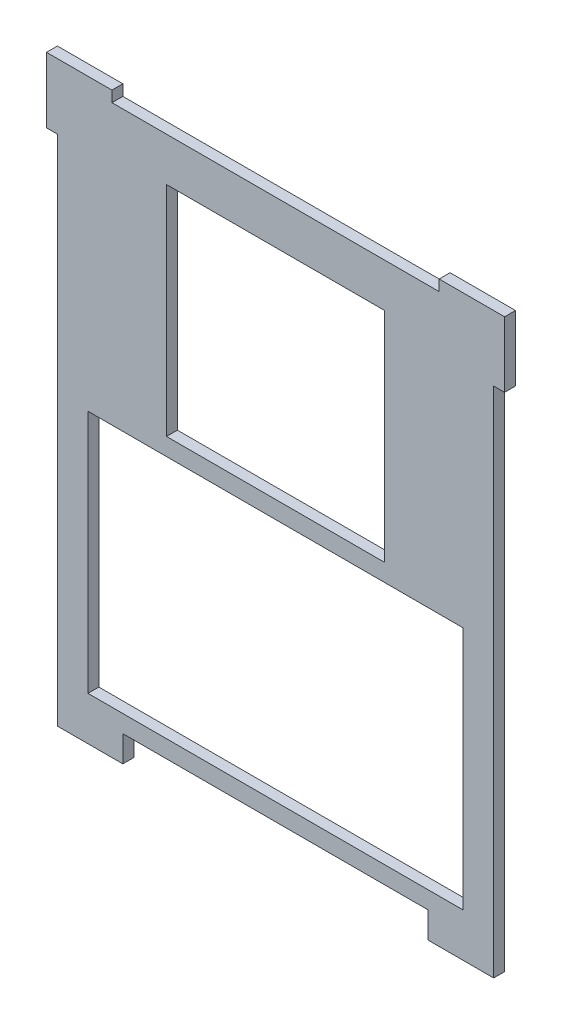
ISO-10303-21;
HEADER;
FILE_DESCRIPTION(('STEP AP214'),'2;1');
FILE_NAME('part.step','',(''),(''),'','','');
FILE_SCHEMA(('AUTOMOTIVE_DESIGN { 1 0 10303 214 1 1 1 1 }'));
ENDSEC;
DATA;
#1=APPLICATION_CONTEXT('core data for automotive mechanical design processes');
#2=APPLICATION_PROTOCOL_DEFINITION('international standard','automotive_design',2000,#1);
#3=PRODUCT_CONTEXT('',#1,'mechanical');
#4=PRODUCT('Part','Part','',(#3));
#5=PRODUCT_RELATED_PRODUCT_CATEGORY('part','',(#4));
#6=PRODUCT_DEFINITION_FORMATION('','',#4);
#7=PRODUCT_DEFINITION_CONTEXT('part definition',#1,'design');
#8=PRODUCT_DEFINITION('design','',#6,#7);
#9=PRODUCT_DEFINITION_SHAPE('','',#8);
#10=(LENGTH_UNIT() NAMED_UNIT(*) SI_UNIT(.MILLI.,.METRE.));
#11=(NAMED_UNIT(*) PLANE_ANGLE_UNIT() SI_UNIT($,.RADIAN.));
#12=(NAMED_UNIT(*) SI_UNIT($,.STERADIAN.) SOLID_ANGLE_UNIT());
#13=UNCERTAINTY_MEASURE_WITH_UNIT(LENGTH_MEASURE(1.E-05),#10,'distance_accuracy_value','');
#14=(GEOMETRIC_REPRESENTATION_CONTEXT(3) GLOBAL_UNCERTAINTY_ASSIGNED_CONTEXT((#13)) GLOBAL_UNIT_ASSIGNED_CONTEXT((#10,
#11,#12)) REPRESENTATION_CONTEXT('',''));
#15=CARTESIAN_POINT('',(0.,0.,0.));
#16=DIRECTION('',(0.,0.,1.));
#17=DIRECTION('',(1.,0.,0.));
#18=AXIS2_PLACEMENT_3D('',#15,#16,#17);
#19=CARTESIAN_POINT('',(-63.5,-88.9,3.175));
#20=DIRECTION('',(1.,0.,0.));
#21=DIRECTION('',(0.,0.,-1.));
#22=AXIS2_PLACEMENT_3D('',#19,#20,#21);
#23=PLANE('',#22);
#24=DIRECTION('',(0.,-1.,0.));
#25=VECTOR('',#24,1.);
#26=CARTESIAN_POINT('',(-63.5,-88.9,0.));
#27=LINE('',#26,#25);
#28=CARTESIAN_POINT('',(-63.5,73.025,0.));
#29=VERTEX_POINT('',#28);
#30=CARTESIAN_POINT('',(-63.5,-76.2,0.));
#31=VERTEX_POINT('',#30);
#32=EDGE_CURVE('E365',#29,#31,#27,.T.);
#33=ORIENTED_EDGE('',*,*,#32,.T.);
#34=DIRECTION('',(0.,0.,1.));
#35=VECTOR('',#34,1.);
#36=CARTESIAN_POINT('',(-63.5,-76.2,-0.00100000000000013));
#37=LINE('',#36,#35);
#38=CARTESIAN_POINT('',(-63.5,-76.2,3.175));
#39=VERTEX_POINT('',#38);
#40=EDGE_CURVE('E238',#31,#39,#37,.T.);
#41=ORIENTED_EDGE('',*,*,#40,.T.);
#42=DIRECTION('',(0.,-1.,0.));
#43=VECTOR('',#42,1.);
#44=CARTESIAN_POINT('',(-63.5,-88.9,3.175));
#45=LINE('',#44,#43);
#46=CARTESIAN_POINT('',(-63.5,73.025,3.175));
#47=VERTEX_POINT('',#46);
#48=EDGE_CURVE('E372',#47,#39,#45,.T.);
#49=ORIENTED_EDGE('',*,*,#48,.F.);
#50=DIRECTION('',(0.,0.,-1.));
#51=VECTOR('',#50,1.);
#52=CARTESIAN_POINT('',(-63.5,73.025,3.175));
#53=LINE('',#52,#51);
#54=EDGE_CURVE('E297',#47,#29,#53,.T.);
#55=ORIENTED_EDGE('',*,*,#54,.T.);
#56=EDGE_LOOP('',(#33,#41,#49,#55));
#57=FACE_BOUND('',#56,.T.);
#58=ADVANCED_FACE('F32',(#57),#23,.F.);
#59=CARTESIAN_POINT('',(63.5,-88.9,3.175));
#60=DIRECTION('',(-1.,0.,0.));
#61=DIRECTION('',(0.,0.,1.));
#62=AXIS2_PLACEMENT_3D('',#59,#60,#61);
#63=PLANE('',#62);
#64=DIRECTION('',(0.,1.,0.));
#65=VECTOR('',#64,1.);
#66=CARTESIAN_POINT('',(63.5,-88.9,3.175));
#67=LINE('',#66,#65);
#68=CARTESIAN_POINT('',(63.5,-76.2,3.175));
#69=VERTEX_POINT('',#68);
#70=CARTESIAN_POINT('',(63.5,73.025,3.175));
#71=VERTEX_POINT('',#70);
#72=EDGE_CURVE('E40',#69,#71,#67,.T.);
#73=ORIENTED_EDGE('',*,*,#72,.F.);
#74=DIRECTION('',(0.,0.,1.));
#75=VECTOR('',#74,1.);
#76=CARTESIAN_POINT('',(63.5,-76.2,-0.00100000000000013));
#77=LINE('',#76,#75);
#78=CARTESIAN_POINT('',(63.5,-76.2,0.));
#79=VERTEX_POINT('',#78);
#80=EDGE_CURVE('E227',#79,#69,#77,.T.);
#81=ORIENTED_EDGE('',*,*,#80,.F.);
#82=DIRECTION('',(0.,1.,0.));
#83=VECTOR('',#82,1.);
#84=CARTESIAN_POINT('',(63.5,-88.9,0.));
#85=LINE('',#84,#83);
#86=CARTESIAN_POINT('',(63.5,73.025,0.));
#87=VERTEX_POINT('',#86);
#88=EDGE_CURVE('E377',#79,#87,#85,.T.);
#89=ORIENTED_EDGE('',*,*,#88,.T.);
#90=DIRECTION('',(0.,0.,1.));
#91=VECTOR('',#90,1.);
#92=CARTESIAN_POINT('',(63.5,73.025,3.175));
#93=LINE('',#92,#91);
#94=EDGE_CURVE('E271',#87,#71,#93,.T.);
#95=ORIENTED_EDGE('',*,*,#94,.T.);
#96=EDGE_LOOP('',(#73,#81,#89,#95));
#97=FACE_BOUND('',#96,.T.);
#98=ADVANCED_FACE('F420',(#97),#63,.F.);
#99=CARTESIAN_POINT('',(63.5,88.9,3.175));
#100=DIRECTION('',(0.,-1.,0.));
#101=DIRECTION('',(1.,0.,0.));
#102=AXIS2_PLACEMENT_3D('',#99,#100,#101);
#103=PLANE('',#102);
#104=DIRECTION('',(-1.,0.,0.));
#105=VECTOR('',#104,1.);
#106=CARTESIAN_POINT('',(63.5,88.9,3.175));
#107=LINE('',#106,#105);
#108=CARTESIAN_POINT('',(47.625,88.9,3.175));
#109=VERTEX_POINT('',#108);
#110=CARTESIAN_POINT('',(-47.625,88.9,3.175));
#111=VERTEX_POINT('',#110);
#112=EDGE_CURVE('E11',#109,#111,#107,.T.);
#113=ORIENTED_EDGE('',*,*,#112,.F.);
#114=DIRECTION('',(0.,0.,-1.));
#115=VECTOR('',#114,1.);
#116=CARTESIAN_POINT('',(47.625,88.9,3.175));
#117=LINE('',#116,#115);
#118=CARTESIAN_POINT('',(47.625,88.9,0.));
#119=VERTEX_POINT('',#118);
#120=EDGE_CURVE('E264',#109,#119,#117,.T.);
#121=ORIENTED_EDGE('',*,*,#120,.T.);
#122=DIRECTION('',(-1.,0.,0.));
#123=VECTOR('',#122,1.);
#124=CARTESIAN_POINT('',(63.5,88.9,0.));
#125=LINE('',#124,#123);
#126=CARTESIAN_POINT('',(-47.625,88.9,0.));
#127=VERTEX_POINT('',#126);
#128=EDGE_CURVE('E35',#119,#127,#125,.T.);
#129=ORIENTED_EDGE('',*,*,#128,.T.);
#130=DIRECTION('',(0.,0.,1.));
#131=VECTOR('',#130,1.);
#132=CARTESIAN_POINT('',(-47.625,88.9,3.175));
#133=LINE('',#132,#131);
#134=EDGE_CURVE('E304',#127,#111,#133,.T.);
#135=ORIENTED_EDGE('',*,*,#134,.T.);
#136=EDGE_LOOP('',(#113,#121,#129,#135));
#137=FACE_BOUND('',#136,.T.);
#138=ADVANCED_FACE('F385',(#137),#103,.F.);
#139=CARTESIAN_POINT('',(0.,0.,3.175));
#140=DIRECTION('',(0.,0.,1.));
#141=DIRECTION('',(1.,0.,0.));
#142=AXIS2_PLACEMENT_3D('',#139,#140,#141);
#143=PLANE('',#142);
#144=DIRECTION('',(0.,-1.,0.));
#145=VECTOR('',#144,1.);
#146=CARTESIAN_POINT('',(-44.45,-76.2,3.175));
#147=LINE('',#146,#145);
#148=CARTESIAN_POINT('',(-44.45,-68.58,3.175));
#149=VERTEX_POINT('',#148);
#150=CARTESIAN_POINT('',(-44.45,-76.2,3.175));
#151=VERTEX_POINT('',#150);
#152=EDGE_CURVE('E216',#149,#151,#147,.T.);
#153=ORIENTED_EDGE('',*,*,#152,.F.);
#154=DIRECTION('',(-1.,0.,0.));
#155=VECTOR('',#154,1.);
#156=CARTESIAN_POINT('',(-44.45,-68.58,3.175));
#157=LINE('',#156,#155);
#158=CARTESIAN_POINT('',(44.45,-68.58,3.175));
#159=VERTEX_POINT('',#158);
#160=EDGE_CURVE('E220',#159,#149,#157,.T.);
#161=ORIENTED_EDGE('',*,*,#160,.F.);
#162=DIRECTION('',(0.,1.,0.));
#163=VECTOR('',#162,1.);
#164=CARTESIAN_POINT('',(44.45,-76.2,3.175));
#165=LINE('',#164,#163);
#166=CARTESIAN_POINT('',(44.45,-76.2,3.175));
#167=VERTEX_POINT('',#166);
#168=EDGE_CURVE('E196',#167,#159,#165,.T.);
#169=ORIENTED_EDGE('',*,*,#168,.F.);
#170=DIRECTION('',(-1.,0.,0.));
#171=VECTOR('',#170,1.);
#172=CARTESIAN_POINT('',(63.5,-76.2,3.175));
#173=LINE('',#172,#171);
#174=EDGE_CURVE('E223',#69,#167,#173,.T.);
#175=ORIENTED_EDGE('',*,*,#174,.F.);
#176=ORIENTED_EDGE('',*,*,#72,.T.);
#177=DIRECTION('',(1.,0.,0.));
#178=VECTOR('',#177,1.);
#179=CARTESIAN_POINT('',(60.325,73.025,3.175));
#180=LINE('',#179,#178);
#181=CARTESIAN_POINT('',(66.675,73.025,3.175));
#182=VERTEX_POINT('',#181);
#183=EDGE_CURVE('E257',#71,#182,#180,.T.);
#184=ORIENTED_EDGE('',*,*,#183,.T.);
#185=DIRECTION('',(0.,1.,0.));
#186=VECTOR('',#185,1.);
#187=CARTESIAN_POINT('',(66.675,85.725,3.175));
#188=LINE('',#187,#186);
#189=CARTESIAN_POINT('',(66.675,92.075,3.175));
#190=VERTEX_POINT('',#189);
#191=EDGE_CURVE('E248',#182,#190,#188,.T.);
#192=ORIENTED_EDGE('',*,*,#191,.T.);
#193=DIRECTION('',(-1.,0.,0.));
#194=VECTOR('',#193,1.);
#195=CARTESIAN_POINT('',(60.325,92.075,3.175));
#196=LINE('',#195,#194);
#197=CARTESIAN_POINT('',(47.625,92.075,3.175));
#198=VERTEX_POINT('',#197);
#199=EDGE_CURVE('E241',#190,#198,#196,.T.);
#200=ORIENTED_EDGE('',*,*,#199,.T.);
#201=DIRECTION('',(0.,-1.,0.));
#202=VECTOR('',#201,1.);
#203=CARTESIAN_POINT('',(47.625,85.725,3.175));
#204=LINE('',#203,#202);
#205=EDGE_CURVE('E55',#198,#109,#204,.T.);
#206=ORIENTED_EDGE('',*,*,#205,.T.);
#207=ORIENTED_EDGE('',*,*,#112,.T.);
#208=DIRECTION('',(0.,1.,0.));
#209=VECTOR('',#208,1.);
#210=CARTESIAN_POINT('',(-47.625,92.075,3.175));
#211=LINE('',#210,#209);
#212=CARTESIAN_POINT('',(-47.625,92.075,3.175));
#213=VERTEX_POINT('',#212);
#214=EDGE_CURVE('E290',#111,#213,#211,.T.);
#215=ORIENTED_EDGE('',*,*,#214,.T.);
#216=DIRECTION('',(-1.,0.,0.));
#217=VECTOR('',#216,1.);
#218=CARTESIAN_POINT('',(-60.325,92.075,3.175));
#219=LINE('',#218,#217);
#220=CARTESIAN_POINT('',(-66.675,92.075,3.175));
#221=VERTEX_POINT('',#220);
#222=EDGE_CURVE('E278',#213,#221,#219,.T.);
#223=ORIENTED_EDGE('',*,*,#222,.T.);
#224=DIRECTION('',(0.,-1.,0.));
#225=VECTOR('',#224,1.);
#226=CARTESIAN_POINT('',(-66.675,85.725,3.175));
#227=LINE('',#226,#225);
#228=CARTESIAN_POINT('',(-66.675,73.025,3.175));
#229=VERTEX_POINT('',#228);
#230=EDGE_CURVE('E274',#221,#229,#227,.T.);
#231=ORIENTED_EDGE('',*,*,#230,.T.);
#232=DIRECTION('',(1.,0.,0.));
#233=VECTOR('',#232,1.);
#234=CARTESIAN_POINT('',(-66.675,73.025,3.175));
#235=LINE('',#234,#233);
#236=EDGE_CURVE('E287',#229,#47,#235,.T.);
#237=ORIENTED_EDGE('',*,*,#236,.T.);
#238=ORIENTED_EDGE('',*,*,#48,.T.);
#239=DIRECTION('',(-1.,0.,0.));
#240=VECTOR('',#239,1.);
#241=CARTESIAN_POINT('',(-63.5,-76.2,3.175));
#242=LINE('',#241,#240);
#243=EDGE_CURVE('E235',#151,#39,#242,.T.);
#244=ORIENTED_EDGE('',*,*,#243,.F.);
#245=EDGE_LOOP('',(#153,#161,#169,#175,#176,#184,#192,#200,#206,#207,#215,#223,#231,#237,#238,#244));
#246=FACE_BOUND('',#245,.T.);
#247=DIRECTION('',(0.,-1.,0.));
#248=VECTOR('',#247,1.);
#249=CARTESIAN_POINT('',(-54.61,-63.5,3.175));
#250=LINE('',#249,#248);
#251=CARTESIAN_POINT('',(-54.61,7.62,3.175));
#252=VERTEX_POINT('',#251);
#253=CARTESIAN_POINT('',(-54.61,-63.5,3.175));
#254=VERTEX_POINT('',#253);
#255=EDGE_CURVE('E307',#252,#254,#250,.T.);
#256=ORIENTED_EDGE('',*,*,#255,.F.);
#257=DIRECTION('',(-1.,0.,0.));
#258=VECTOR('',#257,1.);
#259=CARTESIAN_POINT('',(54.61,7.62000000000002,3.175));
#260=LINE('',#259,#258);
#261=CARTESIAN_POINT('',(54.61,7.62000000000002,3.175));
#262=VERTEX_POINT('',#261);
#263=EDGE_CURVE('E312',#262,#252,#260,.T.);
#264=ORIENTED_EDGE('',*,*,#263,.F.);
#265=DIRECTION('',(0.,1.,0.));
#266=VECTOR('',#265,1.);
#267=CARTESIAN_POINT('',(54.61,-63.5,3.175));
#268=LINE('',#267,#266);
#269=CARTESIAN_POINT('',(54.61,-63.5,3.175));
#270=VERTEX_POINT('',#269);
#271=EDGE_CURVE('E326',#270,#262,#268,.T.);
#272=ORIENTED_EDGE('',*,*,#271,.F.);
#273=DIRECTION('',(1.,0.,0.));
#274=VECTOR('',#273,1.);
#275=CARTESIAN_POINT('',(54.61,-63.5,3.175));
#276=LINE('',#275,#274);
#277=EDGE_CURVE('E323',#254,#270,#276,.T.);
#278=ORIENTED_EDGE('',*,*,#277,.F.);
#279=EDGE_LOOP('',(#256,#264,#272,#278));
#280=FACE_BOUND('',#279,.T.);
#281=DIRECTION('',(0.,-1.,0.));
#282=VECTOR('',#281,1.);
#283=CARTESIAN_POINT('',(-31.75,12.7,3.175));
#284=LINE('',#283,#282);
#285=CARTESIAN_POINT('',(-31.75,76.2,3.175));
#286=VERTEX_POINT('',#285);
#287=CARTESIAN_POINT('',(-31.75,12.7,3.175));
#288=VERTEX_POINT('',#287);
#289=EDGE_CURVE('E333',#286,#288,#284,.T.);
#290=ORIENTED_EDGE('',*,*,#289,.F.);
#291=DIRECTION('',(-1.,0.,0.));
#292=VECTOR('',#291,1.);
#293=CARTESIAN_POINT('',(31.75,76.2,3.175));
#294=LINE('',#293,#292);
#295=CARTESIAN_POINT('',(31.75,76.2,3.175));
#296=VERTEX_POINT('',#295);
#297=EDGE_CURVE('E344',#296,#286,#294,.T.);
#298=ORIENTED_EDGE('',*,*,#297,.F.);
#299=DIRECTION('',(0.,1.,0.));
#300=VECTOR('',#299,1.);
#301=CARTESIAN_POINT('',(31.75,12.7,3.175));
#302=LINE('',#301,#300);
#303=CARTESIAN_POINT('',(31.75,12.7,3.175));
#304=VERTEX_POINT('',#303);
#305=EDGE_CURVE('E358',#304,#296,#302,.T.);
#306=ORIENTED_EDGE('',*,*,#305,.F.);
#307=DIRECTION('',(1.,0.,0.));
#308=VECTOR('',#307,1.);
#309=CARTESIAN_POINT('',(31.75,12.7,3.175));
#310=LINE('',#309,#308);
#311=EDGE_CURVE('E355',#288,#304,#310,.T.);
#312=ORIENTED_EDGE('',*,*,#311,.F.);
#313=EDGE_LOOP('',(#290,#298,#306,#312));
#314=FACE_BOUND('',#313,.T.);
#315=ADVANCED_FACE('F404',(#246,#280,#314),#143,.T.);
#316=CARTESIAN_POINT('',(0.,0.,0.));
#317=DIRECTION('',(0.,0.,1.));
#318=DIRECTION('',(1.,0.,0.));
#319=AXIS2_PLACEMENT_3D('',#316,#317,#318);
#320=PLANE('',#319);
#321=DIRECTION('',(-1.,0.,0.));
#322=VECTOR('',#321,1.);
#323=CARTESIAN_POINT('',(-44.45,-68.58,0.));
#324=LINE('',#323,#322);
#325=CARTESIAN_POINT('',(44.45,-68.58,0.));
#326=VERTEX_POINT('',#325);
#327=CARTESIAN_POINT('',(-44.45,-68.58,0.));
#328=VERTEX_POINT('',#327);
#329=EDGE_CURVE('E201',#326,#328,#324,.T.);
#330=ORIENTED_EDGE('',*,*,#329,.T.);
#331=DIRECTION('',(0.,-1.,0.));
#332=VECTOR('',#331,1.);
#333=CARTESIAN_POINT('',(-44.45,-76.2,0.));
#334=LINE('',#333,#332);
#335=CARTESIAN_POINT('',(-44.45,-76.2,0.));
#336=VERTEX_POINT('',#335);
#337=EDGE_CURVE('E214',#328,#336,#334,.T.);
#338=ORIENTED_EDGE('',*,*,#337,.T.);
#339=DIRECTION('',(1.,0.,0.));
#340=VECTOR('',#339,1.);
#341=CARTESIAN_POINT('',(-63.5,-76.2,0.));
#342=LINE('',#341,#340);
#343=EDGE_CURVE('E232',#31,#336,#342,.T.);
#344=ORIENTED_EDGE('',*,*,#343,.F.);
#345=ORIENTED_EDGE('',*,*,#32,.F.);
#346=DIRECTION('',(1.,0.,0.));
#347=VECTOR('',#346,1.);
#348=CARTESIAN_POINT('',(-66.675,73.025,0.));
#349=LINE('',#348,#347);
#350=CARTESIAN_POINT('',(-66.675,73.025,0.));
#351=VERTEX_POINT('',#350);
#352=EDGE_CURVE('E277',#351,#29,#349,.T.);
#353=ORIENTED_EDGE('',*,*,#352,.F.);
#354=DIRECTION('',(0.,-1.,0.));
#355=VECTOR('',#354,1.);
#356=CARTESIAN_POINT('',(-66.675,85.725,0.));
#357=LINE('',#356,#355);
#358=CARTESIAN_POINT('',(-66.675,92.075,0.));
#359=VERTEX_POINT('',#358);
#360=EDGE_CURVE('E275',#359,#351,#357,.T.);
#361=ORIENTED_EDGE('',*,*,#360,.F.);
#362=DIRECTION('',(-1.,0.,0.));
#363=VECTOR('',#362,1.);
#364=CARTESIAN_POINT('',(-60.325,92.075,0.));
#365=LINE('',#364,#363);
#366=CARTESIAN_POINT('',(-47.625,92.075,0.));
#367=VERTEX_POINT('',#366);
#368=EDGE_CURVE('E282',#367,#359,#365,.T.);
#369=ORIENTED_EDGE('',*,*,#368,.F.);
#370=DIRECTION('',(0.,1.,0.));
#371=VECTOR('',#370,1.);
#372=CARTESIAN_POINT('',(-47.625,92.075,0.));
#373=LINE('',#372,#371);
#374=EDGE_CURVE('E280',#127,#367,#373,.T.);
#375=ORIENTED_EDGE('',*,*,#374,.F.);
#376=ORIENTED_EDGE('',*,*,#128,.F.);
#377=DIRECTION('',(0.,-1.,0.));
#378=VECTOR('',#377,1.);
#379=CARTESIAN_POINT('',(47.625,85.725,0.));
#380=LINE('',#379,#378);
#381=CARTESIAN_POINT('',(47.625,92.075,0.));
#382=VERTEX_POINT('',#381);
#383=EDGE_CURVE('E250',#382,#119,#380,.T.);
#384=ORIENTED_EDGE('',*,*,#383,.F.);
#385=DIRECTION('',(-1.,0.,0.));
#386=VECTOR('',#385,1.);
#387=CARTESIAN_POINT('',(60.325,92.075,0.));
#388=LINE('',#387,#386);
#389=CARTESIAN_POINT('',(66.675,92.075,0.));
#390=VERTEX_POINT('',#389);
#391=EDGE_CURVE('E247',#390,#382,#388,.T.);
#392=ORIENTED_EDGE('',*,*,#391,.F.);
#393=DIRECTION('',(0.,1.,0.));
#394=VECTOR('',#393,1.);
#395=CARTESIAN_POINT('',(66.675,85.725,0.));
#396=LINE('',#395,#394);
#397=CARTESIAN_POINT('',(66.675,73.025,0.));
#398=VERTEX_POINT('',#397);
#399=EDGE_CURVE('E244',#398,#390,#396,.T.);
#400=ORIENTED_EDGE('',*,*,#399,.F.);
#401=DIRECTION('',(1.,0.,0.));
#402=VECTOR('',#401,1.);
#403=CARTESIAN_POINT('',(60.325,73.025,0.));
#404=LINE('',#403,#402);
#405=EDGE_CURVE('E252',#87,#398,#404,.T.);
#406=ORIENTED_EDGE('',*,*,#405,.F.);
#407=ORIENTED_EDGE('',*,*,#88,.F.);
#408=DIRECTION('',(1.,0.,0.));
#409=VECTOR('',#408,1.);
#410=CARTESIAN_POINT('',(63.5,-76.2,0.));
#411=LINE('',#410,#409);
#412=CARTESIAN_POINT('',(44.45,-76.2,0.));
#413=VERTEX_POINT('',#412);
#414=EDGE_CURVE('E213',#413,#79,#411,.T.);
#415=ORIENTED_EDGE('',*,*,#414,.F.);
#416=DIRECTION('',(0.,1.,0.));
#417=VECTOR('',#416,1.);
#418=CARTESIAN_POINT('',(44.45,-88.9,0.));
#419=LINE('',#418,#417);
#420=EDGE_CURVE('E48',#413,#326,#419,.T.);
#421=ORIENTED_EDGE('',*,*,#420,.T.);
#422=EDGE_LOOP('',(#330,#338,#344,#345,#353,#361,#369,#375,#376,#384,#392,#400,#406,#407,#415,#421));
#423=FACE_BOUND('',#422,.T.);
#424=DIRECTION('',(-1.,0.,0.));
#425=VECTOR('',#424,1.);
#426=CARTESIAN_POINT('',(54.61,7.62000000000002,0.));
#427=LINE('',#426,#425);
#428=CARTESIAN_POINT('',(54.61,7.62000000000002,0.));
#429=VERTEX_POINT('',#428);
#430=CARTESIAN_POINT('',(-54.61,7.62,0.));
#431=VERTEX_POINT('',#430);
#432=EDGE_CURVE('E318',#429,#431,#427,.T.);
#433=ORIENTED_EDGE('',*,*,#432,.T.);
#434=DIRECTION('',(0.,-1.,0.));
#435=VECTOR('',#434,1.);
#436=CARTESIAN_POINT('',(-54.61,-63.5,0.));
#437=LINE('',#436,#435);
#438=CARTESIAN_POINT('',(-54.61,-63.5,0.));
#439=VERTEX_POINT('',#438);
#440=EDGE_CURVE('E308',#431,#439,#437,.T.);
#441=ORIENTED_EDGE('',*,*,#440,.T.);
#442=DIRECTION('',(1.,0.,0.));
#443=VECTOR('',#442,1.);
#444=CARTESIAN_POINT('',(54.61,-63.5,0.));
#445=LINE('',#444,#443);
#446=CARTESIAN_POINT('',(54.61,-63.5,0.));
#447=VERTEX_POINT('',#446);
#448=EDGE_CURVE('E311',#439,#447,#445,.T.);
#449=ORIENTED_EDGE('',*,*,#448,.T.);
#450=DIRECTION('',(0.,1.,0.));
#451=VECTOR('',#450,1.);
#452=CARTESIAN_POINT('',(54.61,-63.5,0.));
#453=LINE('',#452,#451);
#454=EDGE_CURVE('E315',#447,#429,#453,.T.);
#455=ORIENTED_EDGE('',*,*,#454,.T.);
#456=EDGE_LOOP('',(#433,#441,#449,#455));
#457=FACE_BOUND('',#456,.T.);
#458=DIRECTION('',(-1.,0.,0.));
#459=VECTOR('',#458,1.);
#460=CARTESIAN_POINT('',(31.75,76.2,0.));
#461=LINE('',#460,#459);
#462=CARTESIAN_POINT('',(31.75,76.2,0.));
#463=VERTEX_POINT('',#462);
#464=CARTESIAN_POINT('',(-31.75,76.2,0.));
#465=VERTEX_POINT('',#464);
#466=EDGE_CURVE('E350',#463,#465,#461,.T.);
#467=ORIENTED_EDGE('',*,*,#466,.T.);
#468=DIRECTION('',(0.,-1.,0.));
#469=VECTOR('',#468,1.);
#470=CARTESIAN_POINT('',(-31.75,12.7,0.));
#471=LINE('',#470,#469);
#472=CARTESIAN_POINT('',(-31.75,12.7,0.));
#473=VERTEX_POINT('',#472);
#474=EDGE_CURVE('E340',#465,#473,#471,.T.);
#475=ORIENTED_EDGE('',*,*,#474,.T.);
#476=DIRECTION('',(1.,0.,0.));
#477=VECTOR('',#476,1.);
#478=CARTESIAN_POINT('',(31.75,12.7,0.));
#479=LINE('',#478,#477);
#480=CARTESIAN_POINT('',(31.75,12.7,0.));
#481=VERTEX_POINT('',#480);
#482=EDGE_CURVE('E343',#473,#481,#479,.T.);
#483=ORIENTED_EDGE('',*,*,#482,.T.);
#484=DIRECTION('',(0.,1.,0.));
#485=VECTOR('',#484,1.);
#486=CARTESIAN_POINT('',(31.75,12.7,0.));
#487=LINE('',#486,#485);
#488=EDGE_CURVE('E347',#481,#463,#487,.T.);
#489=ORIENTED_EDGE('',*,*,#488,.T.);
#490=EDGE_LOOP('',(#467,#475,#483,#489));
#491=FACE_BOUND('',#490,.T.);
#492=ADVANCED_FACE('F210',(#423,#457,#491),#320,.F.);
#493=CARTESIAN_POINT('',(-31.75,12.7,0.));
#494=DIRECTION('',(-1.,0.,0.));
#495=DIRECTION('',(0.,0.,1.));
#496=AXIS2_PLACEMENT_3D('',#493,#494,#495);
#497=PLANE('',#496);
#498=ORIENTED_EDGE('',*,*,#289,.T.);
#499=DIRECTION('',(0.,0.,1.));
#500=VECTOR('',#499,1.);
#501=CARTESIAN_POINT('',(-31.75,12.7,0.));
#502=LINE('',#501,#500);
#503=EDGE_CURVE('E353',#473,#288,#502,.T.);
#504=ORIENTED_EDGE('',*,*,#503,.F.);
#505=ORIENTED_EDGE('',*,*,#474,.F.);
#506=DIRECTION('',(0.,0.,1.));
#507=VECTOR('',#506,1.);
#508=CARTESIAN_POINT('',(-31.75,76.2,0.));
#509=LINE('',#508,#507);
#510=EDGE_CURVE('E363',#465,#286,#509,.T.);
#511=ORIENTED_EDGE('',*,*,#510,.T.);
#512=EDGE_LOOP('',(#498,#504,#505,#511));
#513=FACE_BOUND('',#512,.T.);
#514=ADVANCED_FACE('F458',(#513),#497,.F.);
#515=CARTESIAN_POINT('',(31.75,76.2,0.));
#516=DIRECTION('',(0.,1.,0.));
#517=DIRECTION('',(-1.,0.,0.));
#518=AXIS2_PLACEMENT_3D('',#515,#516,#517);
#519=PLANE('',#518);
#520=ORIENTED_EDGE('',*,*,#297,.T.);
#521=ORIENTED_EDGE('',*,*,#510,.F.);
#522=ORIENTED_EDGE('',*,*,#466,.F.);
#523=DIRECTION('',(0.,0.,1.));
#524=VECTOR('',#523,1.);
#525=CARTESIAN_POINT('',(31.75,76.2,0.));
#526=LINE('',#525,#524);
#527=EDGE_CURVE('E366',#463,#296,#526,.T.);
#528=ORIENTED_EDGE('',*,*,#527,.T.);
#529=EDGE_LOOP('',(#520,#521,#522,#528));
#530=FACE_BOUND('',#529,.T.);
#531=ADVANCED_FACE('F462',(#530),#519,.F.);
#532=CARTESIAN_POINT('',(31.75,12.7,0.));
#533=DIRECTION('',(1.,0.,0.));
#534=DIRECTION('',(0.,0.,-1.));
#535=AXIS2_PLACEMENT_3D('',#532,#533,#534);
#536=PLANE('',#535);
#537=ORIENTED_EDGE('',*,*,#305,.T.);
#538=ORIENTED_EDGE('',*,*,#527,.F.);
#539=ORIENTED_EDGE('',*,*,#488,.F.);
#540=DIRECTION('',(0.,0.,1.));
#541=VECTOR('',#540,1.);
#542=CARTESIAN_POINT('',(31.75,12.7,0.));
#543=LINE('',#542,#541);
#544=EDGE_CURVE('E368',#481,#304,#543,.T.);
#545=ORIENTED_EDGE('',*,*,#544,.T.);
#546=EDGE_LOOP('',(#537,#538,#539,#545));
#547=FACE_BOUND('',#546,.T.);
#548=ADVANCED_FACE('F468',(#547),#536,.F.);
#549=CARTESIAN_POINT('',(31.75,12.7,0.));
#550=DIRECTION('',(0.,-1.,0.));
#551=DIRECTION('',(1.,0.,0.));
#552=AXIS2_PLACEMENT_3D('',#549,#550,#551);
#553=PLANE('',#552);
#554=ORIENTED_EDGE('',*,*,#311,.T.);
#555=ORIENTED_EDGE('',*,*,#544,.F.);
#556=ORIENTED_EDGE('',*,*,#482,.F.);
#557=ORIENTED_EDGE('',*,*,#503,.T.);
#558=EDGE_LOOP('',(#554,#555,#556,#557));
#559=FACE_BOUND('',#558,.T.);
#560=ADVANCED_FACE('F464',(#559),#553,.F.);
#561=CARTESIAN_POINT('',(-54.61,-63.5,0.));
#562=DIRECTION('',(-1.,0.,0.));
#563=DIRECTION('',(0.,-1.,0.));
#564=AXIS2_PLACEMENT_3D('',#561,#562,#563);
#565=PLANE('',#564);
#566=ORIENTED_EDGE('',*,*,#255,.T.);
#567=DIRECTION('',(0.,0.,1.));
#568=VECTOR('',#567,1.);
#569=CARTESIAN_POINT('',(-54.61,-63.5,0.));
#570=LINE('',#569,#568);
#571=EDGE_CURVE('E321',#439,#254,#570,.T.);
#572=ORIENTED_EDGE('',*,*,#571,.F.);
#573=ORIENTED_EDGE('',*,*,#440,.F.);
#574=DIRECTION('',(0.,0.,1.));
#575=VECTOR('',#574,1.);
#576=CARTESIAN_POINT('',(-54.61,7.62,0.));
#577=LINE('',#576,#575);
#578=EDGE_CURVE('E331',#431,#252,#577,.T.);
#579=ORIENTED_EDGE('',*,*,#578,.T.);
#580=EDGE_LOOP('',(#566,#572,#573,#579));
#581=FACE_BOUND('',#580,.T.);
#582=ADVANCED_FACE('F467',(#581),#565,.F.);
#583=CARTESIAN_POINT('',(54.61,7.62000000000002,0.));
#584=DIRECTION('',(0.,1.,0.));
#585=DIRECTION('',(-1.,0.,0.));
#586=AXIS2_PLACEMENT_3D('',#583,#584,#585);
#587=PLANE('',#586);
#588=ORIENTED_EDGE('',*,*,#263,.T.);
#589=ORIENTED_EDGE('',*,*,#578,.F.);
#590=ORIENTED_EDGE('',*,*,#432,.F.);
#591=DIRECTION('',(0.,0.,1.));
#592=VECTOR('',#591,1.);
#593=CARTESIAN_POINT('',(54.61,7.62000000000002,0.));
#594=LINE('',#593,#592);
#595=EDGE_CURVE('E334',#429,#262,#594,.T.);
#596=ORIENTED_EDGE('',*,*,#595,.T.);
#597=EDGE_LOOP('',(#588,#589,#590,#596));
#598=FACE_BOUND('',#597,.T.);
#599=ADVANCED_FACE('F478',(#598),#587,.F.);
#600=CARTESIAN_POINT('',(54.61,-63.5,0.));
#601=DIRECTION('',(1.,0.,0.));
#602=DIRECTION('',(0.,1.,0.));
#603=AXIS2_PLACEMENT_3D('',#600,#601,#602);
#604=PLANE('',#603);
#605=ORIENTED_EDGE('',*,*,#271,.T.);
#606=ORIENTED_EDGE('',*,*,#595,.F.);
#607=ORIENTED_EDGE('',*,*,#454,.F.);
#608=DIRECTION('',(0.,0.,1.));
#609=VECTOR('',#608,1.);
#610=CARTESIAN_POINT('',(54.61,-63.5,0.));
#611=LINE('',#610,#609);
#612=EDGE_CURVE('E336',#447,#270,#611,.T.);
#613=ORIENTED_EDGE('',*,*,#612,.T.);
#614=EDGE_LOOP('',(#605,#606,#607,#613));
#615=FACE_BOUND('',#614,.T.);
#616=ADVANCED_FACE('F483',(#615),#604,.F.);
#617=CARTESIAN_POINT('',(54.61,-63.5,0.));
#618=DIRECTION('',(0.,-1.,0.));
#619=DIRECTION('',(1.,0.,0.));
#620=AXIS2_PLACEMENT_3D('',#617,#618,#619);
#621=PLANE('',#620);
#622=ORIENTED_EDGE('',*,*,#277,.T.);
#623=ORIENTED_EDGE('',*,*,#612,.F.);
#624=ORIENTED_EDGE('',*,*,#448,.F.);
#625=ORIENTED_EDGE('',*,*,#571,.T.);
#626=EDGE_LOOP('',(#622,#623,#624,#625));
#627=FACE_BOUND('',#626,.T.);
#628=ADVANCED_FACE('F480',(#627),#621,.F.);
#629=CARTESIAN_POINT('',(-47.625,92.075,0.));
#630=DIRECTION('',(1.,0.,0.));
#631=DIRECTION('',(0.,0.,-1.));
#632=AXIS2_PLACEMENT_3D('',#629,#630,#631);
#633=PLANE('',#632);
#634=ORIENTED_EDGE('',*,*,#134,.F.);
#635=ORIENTED_EDGE('',*,*,#374,.T.);
#636=DIRECTION('',(0.,0.,1.));
#637=VECTOR('',#636,1.);
#638=CARTESIAN_POINT('',(-47.625,92.075,0.));
#639=LINE('',#638,#637);
#640=EDGE_CURVE('E298',#367,#213,#639,.T.);
#641=ORIENTED_EDGE('',*,*,#640,.T.);
#642=ORIENTED_EDGE('',*,*,#214,.F.);
#643=EDGE_LOOP('',(#634,#635,#641,#642));
#644=FACE_BOUND('',#643,.T.);
#645=ADVANCED_FACE('F390',(#644),#633,.T.);
#646=CARTESIAN_POINT('',(-66.675,73.025,0.));
#647=DIRECTION('',(0.,-1.,0.));
#648=DIRECTION('',(0.,0.,-1.));
#649=AXIS2_PLACEMENT_3D('',#646,#647,#648);
#650=PLANE('',#649);
#651=ORIENTED_EDGE('',*,*,#54,.F.);
#652=ORIENTED_EDGE('',*,*,#236,.F.);
#653=DIRECTION('',(0.,0.,1.));
#654=VECTOR('',#653,1.);
#655=CARTESIAN_POINT('',(-66.675,73.025,0.));
#656=LINE('',#655,#654);
#657=EDGE_CURVE('E284',#351,#229,#656,.T.);
#658=ORIENTED_EDGE('',*,*,#657,.F.);
#659=ORIENTED_EDGE('',*,*,#352,.T.);
#660=EDGE_LOOP('',(#651,#652,#658,#659));
#661=FACE_BOUND('',#660,.T.);
#662=ADVANCED_FACE('F493',(#661),#650,.T.);
#663=CARTESIAN_POINT('',(-60.325,92.075,0.));
#664=DIRECTION('',(0.,1.,0.));
#665=DIRECTION('',(0.,0.,1.));
#666=AXIS2_PLACEMENT_3D('',#663,#664,#665);
#667=PLANE('',#666);
#668=ORIENTED_EDGE('',*,*,#222,.F.);
#669=ORIENTED_EDGE('',*,*,#640,.F.);
#670=ORIENTED_EDGE('',*,*,#368,.T.);
#671=DIRECTION('',(0.,0.,1.));
#672=VECTOR('',#671,1.);
#673=CARTESIAN_POINT('',(-66.675,92.075,0.));
#674=LINE('',#673,#672);
#675=EDGE_CURVE('E294',#359,#221,#674,.T.);
#676=ORIENTED_EDGE('',*,*,#675,.T.);
#677=EDGE_LOOP('',(#668,#669,#670,#676));
#678=FACE_BOUND('',#677,.T.);
#679=ADVANCED_FACE('F398',(#678),#667,.T.);
#680=CARTESIAN_POINT('',(-66.675,85.725,0.));
#681=DIRECTION('',(-1.,0.,0.));
#682=DIRECTION('',(0.,0.,1.));
#683=AXIS2_PLACEMENT_3D('',#680,#681,#682);
#684=PLANE('',#683);
#685=ORIENTED_EDGE('',*,*,#230,.F.);
#686=ORIENTED_EDGE('',*,*,#675,.F.);
#687=ORIENTED_EDGE('',*,*,#360,.T.);
#688=ORIENTED_EDGE('',*,*,#657,.T.);
#689=EDGE_LOOP('',(#685,#686,#687,#688));
#690=FACE_BOUND('',#689,.T.);
#691=ADVANCED_FACE('F400',(#690),#684,.T.);
#692=CARTESIAN_POINT('',(60.325,73.025,0.));
#693=DIRECTION('',(0.,-1.,0.));
#694=DIRECTION('',(0.,0.,-1.));
#695=AXIS2_PLACEMENT_3D('',#692,#693,#694);
#696=PLANE('',#695);
#697=ORIENTED_EDGE('',*,*,#94,.F.);
#698=ORIENTED_EDGE('',*,*,#405,.T.);
#699=DIRECTION('',(0.,0.,1.));
#700=VECTOR('',#699,1.);
#701=CARTESIAN_POINT('',(66.675,73.025,0.));
#702=LINE('',#701,#700);
#703=EDGE_CURVE('E261',#398,#182,#702,.T.);
#704=ORIENTED_EDGE('',*,*,#703,.T.);
#705=ORIENTED_EDGE('',*,*,#183,.F.);
#706=EDGE_LOOP('',(#697,#698,#704,#705));
#707=FACE_BOUND('',#706,.T.);
#708=ADVANCED_FACE('F426',(#707),#696,.T.);
#709=CARTESIAN_POINT('',(47.625,85.725,0.));
#710=DIRECTION('',(-1.,0.,0.));
#711=DIRECTION('',(0.,0.,1.));
#712=AXIS2_PLACEMENT_3D('',#709,#710,#711);
#713=PLANE('',#712);
#714=ORIENTED_EDGE('',*,*,#120,.F.);
#715=ORIENTED_EDGE('',*,*,#205,.F.);
#716=DIRECTION('',(0.,0.,1.));
#717=VECTOR('',#716,1.);
#718=CARTESIAN_POINT('',(47.625,92.075,0.));
#719=LINE('',#718,#717);
#720=EDGE_CURVE('E265',#382,#198,#719,.T.);
#721=ORIENTED_EDGE('',*,*,#720,.F.);
#722=ORIENTED_EDGE('',*,*,#383,.T.);
#723=EDGE_LOOP('',(#714,#715,#721,#722));
#724=FACE_BOUND('',#723,.T.);
#725=ADVANCED_FACE('F435',(#724),#713,.T.);
#726=CARTESIAN_POINT('',(66.675,85.725,0.));
#727=DIRECTION('',(1.,0.,0.));
#728=DIRECTION('',(0.,0.,-1.));
#729=AXIS2_PLACEMENT_3D('',#726,#727,#728);
#730=PLANE('',#729);
#731=ORIENTED_EDGE('',*,*,#191,.F.);
#732=ORIENTED_EDGE('',*,*,#703,.F.);
#733=ORIENTED_EDGE('',*,*,#399,.T.);
#734=DIRECTION('',(0.,0.,1.));
#735=VECTOR('',#734,1.);
#736=CARTESIAN_POINT('',(66.675,92.075,0.));
#737=LINE('',#736,#735);
#738=EDGE_CURVE('E254',#390,#190,#737,.T.);
#739=ORIENTED_EDGE('',*,*,#738,.T.);
#740=EDGE_LOOP('',(#731,#732,#733,#739));
#741=FACE_BOUND('',#740,.T.);
#742=ADVANCED_FACE('F430',(#741),#730,.T.);
#743=CARTESIAN_POINT('',(60.325,92.075,0.));
#744=DIRECTION('',(0.,1.,0.));
#745=DIRECTION('',(0.,0.,1.));
#746=AXIS2_PLACEMENT_3D('',#743,#744,#745);
#747=PLANE('',#746);
#748=ORIENTED_EDGE('',*,*,#199,.F.);
#749=ORIENTED_EDGE('',*,*,#738,.F.);
#750=ORIENTED_EDGE('',*,*,#391,.T.);
#751=ORIENTED_EDGE('',*,*,#720,.T.);
#752=EDGE_LOOP('',(#748,#749,#750,#751));
#753=FACE_BOUND('',#752,.T.);
#754=ADVANCED_FACE('F432',(#753),#747,.T.);
#755=CARTESIAN_POINT('',(-63.5,-76.2,-0.00100000000000013));
#756=DIRECTION('',(0.,1.,0.));
#757=DIRECTION('',(0.,0.,1.));
#758=AXIS2_PLACEMENT_3D('',#755,#756,#757);
#759=PLANE('',#758);
#760=ORIENTED_EDGE('',*,*,#343,.T.);
#761=DIRECTION('',(0.,0.,1.));
#762=VECTOR('',#761,1.);
#763=CARTESIAN_POINT('',(-44.45,-76.2,-0.00100000000000013));
#764=LINE('',#763,#762);
#765=EDGE_CURVE('E237',#336,#151,#764,.T.);
#766=ORIENTED_EDGE('',*,*,#765,.T.);
#767=ORIENTED_EDGE('',*,*,#243,.T.);
#768=ORIENTED_EDGE('',*,*,#40,.F.);
#769=EDGE_LOOP('',(#760,#766,#767,#768));
#770=FACE_BOUND('',#769,.T.);
#771=ADVANCED_FACE('F413',(#770),#759,.F.);
#772=CARTESIAN_POINT('',(63.5,-76.2,-0.00100000000000013));
#773=DIRECTION('',(0.,1.,0.));
#774=DIRECTION('',(-1.,0.,0.));
#775=AXIS2_PLACEMENT_3D('',#772,#773,#774);
#776=PLANE('',#775);
#777=ORIENTED_EDGE('',*,*,#414,.T.);
#778=ORIENTED_EDGE('',*,*,#80,.T.);
#779=ORIENTED_EDGE('',*,*,#174,.T.);
#780=DIRECTION('',(0.,0.,1.));
#781=VECTOR('',#780,1.);
#782=CARTESIAN_POINT('',(44.45,-76.2,-0.00100000000000013));
#783=LINE('',#782,#781);
#784=EDGE_CURVE('E228',#413,#167,#783,.T.);
#785=ORIENTED_EDGE('',*,*,#784,.F.);
#786=EDGE_LOOP('',(#777,#778,#779,#785));
#787=FACE_BOUND('',#786,.T.);
#788=ADVANCED_FACE('F419',(#787),#776,.F.);
#789=CARTESIAN_POINT('',(-44.45,-76.2,0.));
#790=DIRECTION('',(-1.,0.,0.));
#791=DIRECTION('',(0.,0.,1.));
#792=AXIS2_PLACEMENT_3D('',#789,#790,#791);
#793=PLANE('',#792);
#794=ORIENTED_EDGE('',*,*,#337,.F.);
#795=DIRECTION('',(0.,0.,1.));
#796=VECTOR('',#795,1.);
#797=CARTESIAN_POINT('',(-44.45,-68.58,0.));
#798=LINE('',#797,#796);
#799=EDGE_CURVE('E200',#328,#149,#798,.T.);
#800=ORIENTED_EDGE('',*,*,#799,.T.);
#801=ORIENTED_EDGE('',*,*,#152,.T.);
#802=ORIENTED_EDGE('',*,*,#765,.F.);
#803=EDGE_LOOP('',(#794,#800,#801,#802));
#804=FACE_BOUND('',#803,.T.);
#805=ADVANCED_FACE('F415',(#804),#793,.F.);
#806=CARTESIAN_POINT('',(44.45,-76.2,0.));
#807=DIRECTION('',(1.,0.,0.));
#808=DIRECTION('',(0.,0.,-1.));
#809=AXIS2_PLACEMENT_3D('',#806,#807,#808);
#810=PLANE('',#809);
#811=ORIENTED_EDGE('',*,*,#168,.T.);
#812=DIRECTION('',(0.,0.,1.));
#813=VECTOR('',#812,1.);
#814=CARTESIAN_POINT('',(44.45,-68.58,0.));
#815=LINE('',#814,#813);
#816=EDGE_CURVE('E192',#326,#159,#815,.T.);
#817=ORIENTED_EDGE('',*,*,#816,.F.);
#818=ORIENTED_EDGE('',*,*,#420,.F.);
#819=ORIENTED_EDGE('',*,*,#784,.T.);
#820=EDGE_LOOP('',(#811,#817,#818,#819));
#821=FACE_BOUND('',#820,.T.);
#822=ADVANCED_FACE('F194',(#821),#810,.F.);
#823=CARTESIAN_POINT('',(-44.45,-68.58,0.));
#824=DIRECTION('',(0.,1.,0.));
#825=DIRECTION('',(0.,0.,1.));
#826=AXIS2_PLACEMENT_3D('',#823,#824,#825);
#827=PLANE('',#826);
#828=ORIENTED_EDGE('',*,*,#160,.T.);
#829=ORIENTED_EDGE('',*,*,#799,.F.);
#830=ORIENTED_EDGE('',*,*,#329,.F.);
#831=ORIENTED_EDGE('',*,*,#816,.T.);
#832=EDGE_LOOP('',(#828,#829,#830,#831));
#833=FACE_BOUND('',#832,.T.);
#834=ADVANCED_FACE('F205',(#833),#827,.F.);
#835=CLOSED_SHELL('',(#58,#98,#138,#315,#492,#514,#531,#548,#560,#582,#599,#616,#628,#645,#662,
#679,#691,#708,#725,#742,#754,#771,#788,#805,#822,#834));
#836=MANIFOLD_SOLID_BREP('B2',#835);
#837=ADVANCED_BREP_SHAPE_REPRESENTATION('',(#18,#836),#14);
#838=SHAPE_DEFINITION_REPRESENTATION(#9,#837);
ENDSEC;
END-ISO-10303-21;
